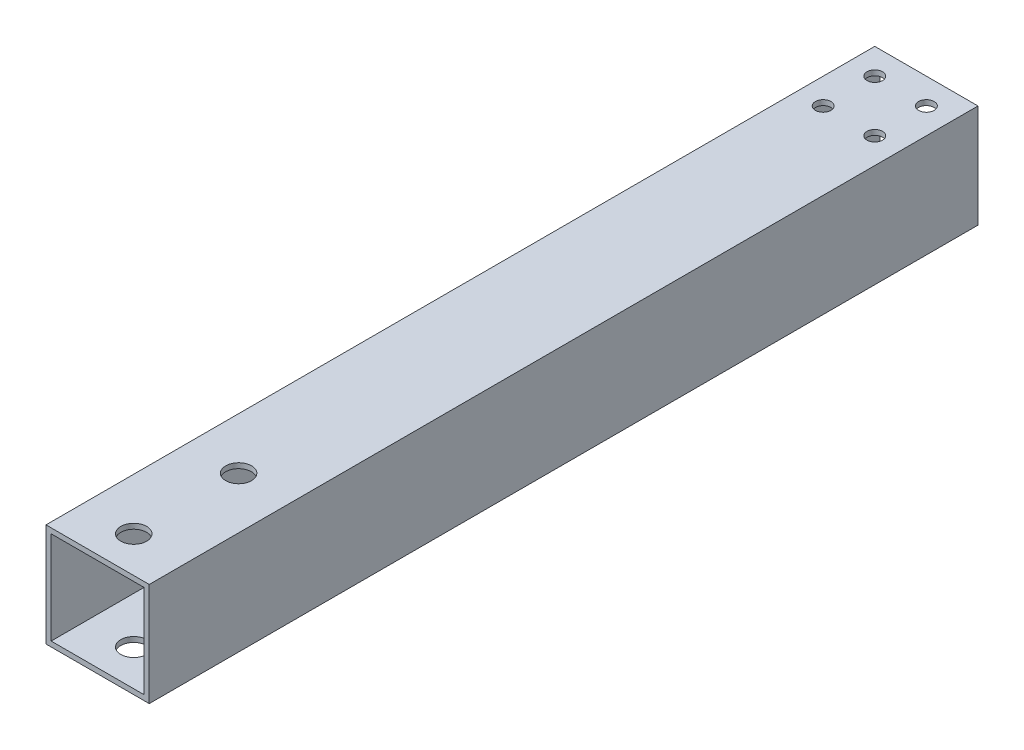
ISO-10303-21;
HEADER;
FILE_DESCRIPTION(('STEP AP214'),'2;1');
FILE_NAME('part.step','',(''),(''),'','','');
FILE_SCHEMA(('AUTOMOTIVE_DESIGN { 1 0 10303 214 1 1 1 1 }'));
ENDSEC;
DATA;
#1=APPLICATION_CONTEXT('core data for automotive mechanical design processes');
#2=APPLICATION_PROTOCOL_DEFINITION('international standard','automotive_design',2000,#1);
#3=PRODUCT_CONTEXT('',#1,'mechanical');
#4=PRODUCT('Part','Part','',(#3));
#5=PRODUCT_RELATED_PRODUCT_CATEGORY('part','',(#4));
#6=PRODUCT_DEFINITION_FORMATION('','',#4);
#7=PRODUCT_DEFINITION_CONTEXT('part definition',#1,'design');
#8=PRODUCT_DEFINITION('design','',#6,#7);
#9=PRODUCT_DEFINITION_SHAPE('','',#8);
#10=(LENGTH_UNIT() NAMED_UNIT(*) SI_UNIT(.MILLI.,.METRE.));
#11=(NAMED_UNIT(*) PLANE_ANGLE_UNIT() SI_UNIT($,.RADIAN.));
#12=(NAMED_UNIT(*) SI_UNIT($,.STERADIAN.) SOLID_ANGLE_UNIT());
#13=UNCERTAINTY_MEASURE_WITH_UNIT(LENGTH_MEASURE(1.E-05),#10,'distance_accuracy_value','');
#14=(GEOMETRIC_REPRESENTATION_CONTEXT(3) GLOBAL_UNCERTAINTY_ASSIGNED_CONTEXT((#13)) GLOBAL_UNIT_ASSIGNED_CONTEXT((#10,
#11,#12)) REPRESENTATION_CONTEXT('',''));
#15=CARTESIAN_POINT('',(0.,0.,0.));
#16=DIRECTION('',(0.,0.,1.));
#17=DIRECTION('',(1.,0.,0.));
#18=AXIS2_PLACEMENT_3D('',#15,#16,#17);
#19=CARTESIAN_POINT('',(10.,10.,171.98));
#20=DIRECTION('',(-1.,0.,0.));
#21=DIRECTION('',(0.,-1.,0.));
#22=AXIS2_PLACEMENT_3D('',#19,#20,#21);
#23=PLANE('',#22);
#24=DIRECTION('',(0.,1.,0.));
#25=VECTOR('',#24,1.);
#26=CARTESIAN_POINT('',(10.,-23.,160.58));
#27=LINE('',#26,#25);
#28=CARTESIAN_POINT('',(10.,-10.,160.58));
#29=VERTEX_POINT('',#28);
#30=CARTESIAN_POINT('',(10.,10.,160.58));
#31=VERTEX_POINT('',#30);
#32=EDGE_CURVE('E99',#29,#31,#27,.T.);
#33=ORIENTED_EDGE('',*,*,#32,.F.);
#34=DIRECTION('',(0.,0.,-1.));
#35=VECTOR('',#34,1.);
#36=CARTESIAN_POINT('',(10.,-10.,171.98));
#37=LINE('',#36,#35);
#38=CARTESIAN_POINT('',(10.,-10.,0.));
#39=VERTEX_POINT('',#38);
#40=EDGE_CURVE('E119',#29,#39,#37,.T.);
#41=ORIENTED_EDGE('',*,*,#40,.T.);
#42=DIRECTION('',(0.,1.,0.));
#43=VECTOR('',#42,1.);
#44=CARTESIAN_POINT('',(10.,10.,0.));
#45=LINE('',#44,#43);
#46=CARTESIAN_POINT('',(10.,10.,0.));
#47=VERTEX_POINT('',#46);
#48=EDGE_CURVE('E214',#39,#47,#45,.T.);
#49=ORIENTED_EDGE('',*,*,#48,.T.);
#50=DIRECTION('',(0.,0.,-1.));
#51=VECTOR('',#50,1.);
#52=CARTESIAN_POINT('',(10.,10.,171.98));
#53=LINE('',#52,#51);
#54=EDGE_CURVE('E42',#31,#47,#53,.T.);
#55=ORIENTED_EDGE('',*,*,#54,.F.);
#56=EDGE_LOOP('',(#33,#41,#49,#55));
#57=FACE_BOUND('',#56,.T.);
#58=ADVANCED_FACE('F35',(#57),#23,.F.);
#59=CARTESIAN_POINT('',(-9.99999999999999,10.,171.98));
#60=DIRECTION('',(0.,-1.,0.));
#61=DIRECTION('',(0.,0.,-1.));
#62=AXIS2_PLACEMENT_3D('',#59,#60,#61);
#63=PLANE('',#62);
#64=CARTESIAN_POINT('',(-4.99999999999999,10.,5.));
#65=DIRECTION('',(0.,1.,0.));
#66=DIRECTION('',(0.,0.,1.));
#67=AXIS2_PLACEMENT_3D('',#64,#65,#66);
#68=CIRCLE('',#67,1.5);
#69=CARTESIAN_POINT('',(-4.99999999999999,10.,6.5));
#70=VERTEX_POINT('',#69);
#71=EDGE_CURVE('E127',#70,#70,#68,.T.);
#72=ORIENTED_EDGE('',*,*,#71,.F.);
#73=EDGE_LOOP('',(#72));
#74=FACE_BOUND('',#73,.T.);
#75=CARTESIAN_POINT('',(5.00000000000001,10.,5.));
#76=DIRECTION('',(0.,1.,0.));
#77=DIRECTION('',(0.,0.,1.));
#78=AXIS2_PLACEMENT_3D('',#75,#76,#77);
#79=CIRCLE('',#78,1.5);
#80=CARTESIAN_POINT('',(5.00000000000001,10.,6.5));
#81=VERTEX_POINT('',#80);
#82=EDGE_CURVE('E170',#81,#81,#79,.T.);
#83=ORIENTED_EDGE('',*,*,#82,.F.);
#84=EDGE_LOOP('',(#83));
#85=FACE_BOUND('',#84,.T.);
#86=CARTESIAN_POINT('',(-4.99999999999999,10.,15.));
#87=DIRECTION('',(0.,1.,0.));
#88=DIRECTION('',(0.,0.,1.));
#89=AXIS2_PLACEMENT_3D('',#86,#87,#88);
#90=CIRCLE('',#89,1.5);
#91=CARTESIAN_POINT('',(-4.99999999999999,10.,16.5));
#92=VERTEX_POINT('',#91);
#93=EDGE_CURVE('E169',#92,#92,#90,.T.);
#94=ORIENTED_EDGE('',*,*,#93,.F.);
#95=EDGE_LOOP('',(#94));
#96=FACE_BOUND('',#95,.T.);
#97=CARTESIAN_POINT('',(5.00000000000001,10.,15.));
#98=DIRECTION('',(0.,1.,0.));
#99=DIRECTION('',(0.,0.,1.));
#100=AXIS2_PLACEMENT_3D('',#97,#98,#99);
#101=CIRCLE('',#100,1.5);
#102=CARTESIAN_POINT('',(5.00000000000001,10.,16.5));
#103=VERTEX_POINT('',#102);
#104=EDGE_CURVE('E166',#103,#103,#101,.T.);
#105=ORIENTED_EDGE('',*,*,#104,.F.);
#106=EDGE_LOOP('',(#105));
#107=FACE_BOUND('',#106,.T.);
#108=CARTESIAN_POINT('',(0.,10.,133.26));
#109=DIRECTION('',(0.,1.,0.));
#110=DIRECTION('',(0.,0.,1.));
#111=AXIS2_PLACEMENT_3D('',#108,#109,#110);
#112=CIRCLE('',#111,2.5);
#113=CARTESIAN_POINT('',(0.,10.,135.76));
#114=VERTEX_POINT('',#113);
#115=EDGE_CURVE('E260',#114,#114,#112,.T.);
#116=ORIENTED_EDGE('',*,*,#115,.F.);
#117=EDGE_LOOP('',(#116));
#118=FACE_BOUND('',#117,.T.);
#119=CARTESIAN_POINT('',(0.,10.,153.58));
#120=DIRECTION('',(0.,1.,0.));
#121=DIRECTION('',(0.,0.,1.));
#122=AXIS2_PLACEMENT_3D('',#119,#120,#121);
#123=CIRCLE('',#122,2.5);
#124=CARTESIAN_POINT('',(0.,10.,156.08));
#125=VERTEX_POINT('',#124);
#126=EDGE_CURVE('E146',#125,#125,#123,.T.);
#127=ORIENTED_EDGE('',*,*,#126,.F.);
#128=EDGE_LOOP('',(#127));
#129=FACE_BOUND('',#128,.T.);
#130=DIRECTION('',(1.,0.,0.));
#131=VECTOR('',#130,1.);
#132=CARTESIAN_POINT('',(-9.99999999999999,10.,160.58));
#133=LINE('',#132,#131);
#134=CARTESIAN_POINT('',(-9.99999999999999,10.,160.58));
#135=VERTEX_POINT('',#134);
#136=EDGE_CURVE('E96',#135,#31,#133,.T.);
#137=ORIENTED_EDGE('',*,*,#136,.T.);
#138=ORIENTED_EDGE('',*,*,#54,.T.);
#139=DIRECTION('',(-1.,0.,0.));
#140=VECTOR('',#139,1.);
#141=CARTESIAN_POINT('',(-9.99999999999999,10.,0.));
#142=LINE('',#141,#140);
#143=CARTESIAN_POINT('',(-9.99999999999999,10.,0.));
#144=VERTEX_POINT('',#143);
#145=EDGE_CURVE('E115',#47,#144,#142,.T.);
#146=ORIENTED_EDGE('',*,*,#145,.T.);
#147=DIRECTION('',(0.,0.,-1.));
#148=VECTOR('',#147,1.);
#149=CARTESIAN_POINT('',(-9.99999999999999,10.,171.98));
#150=LINE('',#149,#148);
#151=EDGE_CURVE('E108',#135,#144,#150,.T.);
#152=ORIENTED_EDGE('',*,*,#151,.F.);
#153=EDGE_LOOP('',(#137,#138,#146,#152));
#154=FACE_BOUND('',#153,.T.);
#155=ADVANCED_FACE('F113',(#74,#85,#96,#107,#118,#129,#154),#63,.F.);
#156=CARTESIAN_POINT('',(-9.99999999999999,10.,171.98));
#157=DIRECTION('',(1.,0.,0.));
#158=DIRECTION('',(0.,0.,-1.));
#159=AXIS2_PLACEMENT_3D('',#156,#157,#158);
#160=PLANE('',#159);
#161=DIRECTION('',(0.,1.,0.));
#162=VECTOR('',#161,1.);
#163=CARTESIAN_POINT('',(-9.99999999999999,-23.,160.58));
#164=LINE('',#163,#162);
#165=CARTESIAN_POINT('',(-9.99999999999999,-10.,160.58));
#166=VERTEX_POINT('',#165);
#167=EDGE_CURVE('E49',#166,#135,#164,.T.);
#168=ORIENTED_EDGE('',*,*,#167,.T.);
#169=ORIENTED_EDGE('',*,*,#151,.T.);
#170=DIRECTION('',(0.,-1.,0.));
#171=VECTOR('',#170,1.);
#172=CARTESIAN_POINT('',(-9.99999999999999,10.,0.));
#173=LINE('',#172,#171);
#174=CARTESIAN_POINT('',(-9.99999999999999,-10.,0.));
#175=VERTEX_POINT('',#174);
#176=EDGE_CURVE('E218',#144,#175,#173,.T.);
#177=ORIENTED_EDGE('',*,*,#176,.T.);
#178=DIRECTION('',(0.,0.,-1.));
#179=VECTOR('',#178,1.);
#180=CARTESIAN_POINT('',(-9.99999999999999,-10.,171.98));
#181=LINE('',#180,#179);
#182=EDGE_CURVE('E110',#166,#175,#181,.T.);
#183=ORIENTED_EDGE('',*,*,#182,.F.);
#184=EDGE_LOOP('',(#168,#169,#177,#183));
#185=FACE_BOUND('',#184,.T.);
#186=ADVANCED_FACE('F106',(#185),#160,.F.);
#187=CARTESIAN_POINT('',(-9.99999999999999,-10.,171.98));
#188=DIRECTION('',(0.,1.,0.));
#189=DIRECTION('',(0.,0.,1.));
#190=AXIS2_PLACEMENT_3D('',#187,#188,#189);
#191=PLANE('',#190);
#192=CARTESIAN_POINT('',(-4.99999999999999,-10.,5.));
#193=DIRECTION('',(0.,1.,0.));
#194=DIRECTION('',(0.,0.,1.));
#195=AXIS2_PLACEMENT_3D('',#192,#193,#194);
#196=CIRCLE('',#195,1.5);
#197=CARTESIAN_POINT('',(-4.99999999999999,-10.,6.5));
#198=VERTEX_POINT('',#197);
#199=EDGE_CURVE('E132',#198,#198,#196,.T.);
#200=ORIENTED_EDGE('',*,*,#199,.T.);
#201=EDGE_LOOP('',(#200));
#202=FACE_BOUND('',#201,.T.);
#203=CARTESIAN_POINT('',(5.00000000000001,-10.,5.));
#204=DIRECTION('',(0.,1.,0.));
#205=DIRECTION('',(0.,0.,1.));
#206=AXIS2_PLACEMENT_3D('',#203,#204,#205);
#207=CIRCLE('',#206,1.5);
#208=CARTESIAN_POINT('',(5.00000000000001,-10.,6.5));
#209=VERTEX_POINT('',#208);
#210=EDGE_CURVE('E137',#209,#209,#207,.T.);
#211=ORIENTED_EDGE('',*,*,#210,.T.);
#212=EDGE_LOOP('',(#211));
#213=FACE_BOUND('',#212,.T.);
#214=CARTESIAN_POINT('',(-4.99999999999999,-10.,15.));
#215=DIRECTION('',(0.,1.,0.));
#216=DIRECTION('',(0.,0.,1.));
#217=AXIS2_PLACEMENT_3D('',#214,#215,#216);
#218=CIRCLE('',#217,1.5);
#219=CARTESIAN_POINT('',(-4.99999999999999,-10.,16.5));
#220=VERTEX_POINT('',#219);
#221=EDGE_CURVE('E142',#220,#220,#218,.T.);
#222=ORIENTED_EDGE('',*,*,#221,.T.);
#223=EDGE_LOOP('',(#222));
#224=FACE_BOUND('',#223,.T.);
#225=CARTESIAN_POINT('',(5.00000000000001,-10.,15.));
#226=DIRECTION('',(0.,1.,0.));
#227=DIRECTION('',(0.,0.,1.));
#228=AXIS2_PLACEMENT_3D('',#225,#226,#227);
#229=CIRCLE('',#228,1.5);
#230=CARTESIAN_POINT('',(5.00000000000001,-10.,16.5));
#231=VERTEX_POINT('',#230);
#232=EDGE_CURVE('E191',#231,#231,#229,.T.);
#233=ORIENTED_EDGE('',*,*,#232,.T.);
#234=EDGE_LOOP('',(#233));
#235=FACE_BOUND('',#234,.T.);
#236=CARTESIAN_POINT('',(0.,-10.,133.26));
#237=DIRECTION('',(0.,1.,0.));
#238=DIRECTION('',(0.,0.,1.));
#239=AXIS2_PLACEMENT_3D('',#236,#237,#238);
#240=CIRCLE('',#239,2.5);
#241=CARTESIAN_POINT('',(0.,-10.,135.76));
#242=VERTEX_POINT('',#241);
#243=EDGE_CURVE('E150',#242,#242,#240,.T.);
#244=ORIENTED_EDGE('',*,*,#243,.T.);
#245=EDGE_LOOP('',(#244));
#246=FACE_BOUND('',#245,.T.);
#247=CARTESIAN_POINT('',(0.,-10.,153.58));
#248=DIRECTION('',(0.,1.,0.));
#249=DIRECTION('',(0.,0.,1.));
#250=AXIS2_PLACEMENT_3D('',#247,#248,#249);
#251=CIRCLE('',#250,2.5);
#252=CARTESIAN_POINT('',(0.,-10.,156.08));
#253=VERTEX_POINT('',#252);
#254=EDGE_CURVE('E154',#253,#253,#251,.T.);
#255=ORIENTED_EDGE('',*,*,#254,.T.);
#256=EDGE_LOOP('',(#255));
#257=FACE_BOUND('',#256,.T.);
#258=DIRECTION('',(1.,0.,0.));
#259=VECTOR('',#258,1.);
#260=CARTESIAN_POINT('',(-9.99999999999999,-10.,160.58));
#261=LINE('',#260,#259);
#262=EDGE_CURVE('E258',#166,#29,#261,.T.);
#263=ORIENTED_EDGE('',*,*,#262,.F.);
#264=ORIENTED_EDGE('',*,*,#182,.T.);
#265=DIRECTION('',(1.,0.,0.));
#266=VECTOR('',#265,1.);
#267=CARTESIAN_POINT('',(-9.99999999999999,-10.,0.));
#268=LINE('',#267,#266);
#269=EDGE_CURVE('E220',#175,#39,#268,.T.);
#270=ORIENTED_EDGE('',*,*,#269,.T.);
#271=ORIENTED_EDGE('',*,*,#40,.F.);
#272=EDGE_LOOP('',(#263,#264,#270,#271));
#273=FACE_BOUND('',#272,.T.);
#274=ADVANCED_FACE('F227',(#202,#213,#224,#235,#246,#257,#273),#191,.F.);
#275=CARTESIAN_POINT('',(9.00000000000001,9.,171.98));
#276=DIRECTION('',(-1.,0.,0.));
#277=DIRECTION('',(0.,-1.,0.));
#278=AXIS2_PLACEMENT_3D('',#275,#276,#277);
#279=PLANE('',#278);
#280=DIRECTION('',(0.,0.,-1.));
#281=VECTOR('',#280,1.);
#282=CARTESIAN_POINT('',(9.00000000000001,-9.,171.98));
#283=LINE('',#282,#281);
#284=CARTESIAN_POINT('',(9.00000000000001,-9.,160.58));
#285=VERTEX_POINT('',#284);
#286=CARTESIAN_POINT('',(9.00000000000001,-9.,0.));
#287=VERTEX_POINT('',#286);
#288=EDGE_CURVE('E206',#285,#287,#283,.T.);
#289=ORIENTED_EDGE('',*,*,#288,.F.);
#290=DIRECTION('',(0.,1.,0.));
#291=VECTOR('',#290,1.);
#292=CARTESIAN_POINT('',(9.00000000000001,9.,160.58));
#293=LINE('',#292,#291);
#294=CARTESIAN_POINT('',(9.,9.,160.58));
#295=VERTEX_POINT('',#294);
#296=EDGE_CURVE('E57',#285,#295,#293,.T.);
#297=ORIENTED_EDGE('',*,*,#296,.T.);
#298=DIRECTION('',(0.,0.,-1.));
#299=VECTOR('',#298,1.);
#300=CARTESIAN_POINT('',(9.00000000000001,9.,171.98));
#301=LINE('',#300,#299);
#302=CARTESIAN_POINT('',(9.00000000000001,9.,0.));
#303=VERTEX_POINT('',#302);
#304=EDGE_CURVE('E212',#295,#303,#301,.T.);
#305=ORIENTED_EDGE('',*,*,#304,.T.);
#306=DIRECTION('',(0.,1.,0.));
#307=VECTOR('',#306,1.);
#308=CARTESIAN_POINT('',(9.00000000000001,9.,0.));
#309=LINE('',#308,#307);
#310=EDGE_CURVE('E194',#287,#303,#309,.T.);
#311=ORIENTED_EDGE('',*,*,#310,.F.);
#312=EDGE_LOOP('',(#289,#297,#305,#311));
#313=FACE_BOUND('',#312,.T.);
#314=ADVANCED_FACE('F240',(#313),#279,.T.);
#315=CARTESIAN_POINT('',(-8.99999999999999,9.,171.98));
#316=DIRECTION('',(0.,-1.,0.));
#317=DIRECTION('',(0.,0.,-1.));
#318=AXIS2_PLACEMENT_3D('',#315,#316,#317);
#319=PLANE('',#318);
#320=CARTESIAN_POINT('',(0.,9.,153.58));
#321=DIRECTION('',(0.,-1.,0.));
#322=DIRECTION('',(0.,0.,-1.));
#323=AXIS2_PLACEMENT_3D('',#320,#321,#322);
#324=CIRCLE('',#323,2.5);
#325=CARTESIAN_POINT('',(0.,9.,151.08));
#326=VERTEX_POINT('',#325);
#327=EDGE_CURVE('E149',#326,#326,#324,.T.);
#328=ORIENTED_EDGE('',*,*,#327,.F.);
#329=EDGE_LOOP('',(#328));
#330=FACE_BOUND('',#329,.T.);
#331=CARTESIAN_POINT('',(0.,9.,133.26));
#332=DIRECTION('',(0.,-1.,0.));
#333=DIRECTION('',(0.,0.,-1.));
#334=AXIS2_PLACEMENT_3D('',#331,#332,#333);
#335=CIRCLE('',#334,2.5);
#336=CARTESIAN_POINT('',(0.,9.,130.76));
#337=VERTEX_POINT('',#336);
#338=EDGE_CURVE('E145',#337,#337,#335,.T.);
#339=ORIENTED_EDGE('',*,*,#338,.F.);
#340=EDGE_LOOP('',(#339));
#341=FACE_BOUND('',#340,.T.);
#342=CARTESIAN_POINT('',(5.00000000000001,9.,15.));
#343=DIRECTION('',(0.,-1.,0.));
#344=DIRECTION('',(0.,0.,-1.));
#345=AXIS2_PLACEMENT_3D('',#342,#343,#344);
#346=CIRCLE('',#345,1.5);
#347=CARTESIAN_POINT('',(5.00000000000001,9.,13.5));
#348=VERTEX_POINT('',#347);
#349=EDGE_CURVE('E141',#348,#348,#346,.T.);
#350=ORIENTED_EDGE('',*,*,#349,.F.);
#351=EDGE_LOOP('',(#350));
#352=FACE_BOUND('',#351,.T.);
#353=CARTESIAN_POINT('',(-4.99999999999999,9.,15.));
#354=DIRECTION('',(0.,-1.,0.));
#355=DIRECTION('',(0.,0.,-1.));
#356=AXIS2_PLACEMENT_3D('',#353,#354,#355);
#357=CIRCLE('',#356,1.5);
#358=CARTESIAN_POINT('',(-4.99999999999999,9.,13.5));
#359=VERTEX_POINT('',#358);
#360=EDGE_CURVE('E136',#359,#359,#357,.T.);
#361=ORIENTED_EDGE('',*,*,#360,.F.);
#362=EDGE_LOOP('',(#361));
#363=FACE_BOUND('',#362,.T.);
#364=CARTESIAN_POINT('',(5.00000000000001,9.,5.));
#365=DIRECTION('',(0.,-1.,0.));
#366=DIRECTION('',(0.,0.,-1.));
#367=AXIS2_PLACEMENT_3D('',#364,#365,#366);
#368=CIRCLE('',#367,1.5);
#369=CARTESIAN_POINT('',(5.00000000000001,9.,3.5));
#370=VERTEX_POINT('',#369);
#371=EDGE_CURVE('E131',#370,#370,#368,.T.);
#372=ORIENTED_EDGE('',*,*,#371,.F.);
#373=EDGE_LOOP('',(#372));
#374=FACE_BOUND('',#373,.T.);
#375=CARTESIAN_POINT('',(-4.99999999999999,9.,5.));
#376=DIRECTION('',(0.,-1.,0.));
#377=DIRECTION('',(0.,0.,-1.));
#378=AXIS2_PLACEMENT_3D('',#375,#376,#377);
#379=CIRCLE('',#378,1.5);
#380=CARTESIAN_POINT('',(-4.99999999999999,9.,3.5));
#381=VERTEX_POINT('',#380);
#382=EDGE_CURVE('E126',#381,#381,#379,.T.);
#383=ORIENTED_EDGE('',*,*,#382,.F.);
#384=EDGE_LOOP('',(#383));
#385=FACE_BOUND('',#384,.T.);
#386=ORIENTED_EDGE('',*,*,#304,.F.);
#387=DIRECTION('',(-1.,0.,0.));
#388=VECTOR('',#387,1.);
#389=CARTESIAN_POINT('',(-8.99999999999999,9.,160.58));
#390=LINE('',#389,#388);
#391=CARTESIAN_POINT('',(-8.99999999999999,9.,160.58));
#392=VERTEX_POINT('',#391);
#393=EDGE_CURVE('E247',#295,#392,#390,.T.);
#394=ORIENTED_EDGE('',*,*,#393,.T.);
#395=DIRECTION('',(0.,0.,-1.));
#396=VECTOR('',#395,1.);
#397=CARTESIAN_POINT('',(-8.99999999999999,9.,171.98));
#398=LINE('',#397,#396);
#399=CARTESIAN_POINT('',(-8.99999999999999,9.,0.));
#400=VERTEX_POINT('',#399);
#401=EDGE_CURVE('E210',#392,#400,#398,.T.);
#402=ORIENTED_EDGE('',*,*,#401,.T.);
#403=DIRECTION('',(-1.,0.,0.));
#404=VECTOR('',#403,1.);
#405=CARTESIAN_POINT('',(-8.99999999999999,9.,0.));
#406=LINE('',#405,#404);
#407=EDGE_CURVE('E197',#303,#400,#406,.T.);
#408=ORIENTED_EDGE('',*,*,#407,.F.);
#409=EDGE_LOOP('',(#386,#394,#402,#408));
#410=FACE_BOUND('',#409,.T.);
#411=ADVANCED_FACE('F244',(#330,#341,#352,#363,#374,#385,#410),#319,.T.);
#412=CARTESIAN_POINT('',(-8.99999999999999,9.,171.98));
#413=DIRECTION('',(1.,0.,0.));
#414=DIRECTION('',(0.,1.,0.));
#415=AXIS2_PLACEMENT_3D('',#412,#413,#414);
#416=PLANE('',#415);
#417=ORIENTED_EDGE('',*,*,#401,.F.);
#418=DIRECTION('',(0.,-1.,0.));
#419=VECTOR('',#418,1.);
#420=CARTESIAN_POINT('',(-8.99999999999999,9.,160.58));
#421=LINE('',#420,#419);
#422=CARTESIAN_POINT('',(-8.99999999999999,-9.,160.58));
#423=VERTEX_POINT('',#422);
#424=EDGE_CURVE('E111',#392,#423,#421,.T.);
#425=ORIENTED_EDGE('',*,*,#424,.T.);
#426=DIRECTION('',(0.,0.,-1.));
#427=VECTOR('',#426,1.);
#428=CARTESIAN_POINT('',(-8.99999999999999,-9.,171.98));
#429=LINE('',#428,#427);
#430=CARTESIAN_POINT('',(-8.99999999999999,-9.,0.));
#431=VERTEX_POINT('',#430);
#432=EDGE_CURVE('E208',#423,#431,#429,.T.);
#433=ORIENTED_EDGE('',*,*,#432,.T.);
#434=DIRECTION('',(0.,-1.,0.));
#435=VECTOR('',#434,1.);
#436=CARTESIAN_POINT('',(-8.99999999999999,9.,0.));
#437=LINE('',#436,#435);
#438=EDGE_CURVE('E200',#400,#431,#437,.T.);
#439=ORIENTED_EDGE('',*,*,#438,.F.);
#440=EDGE_LOOP('',(#417,#425,#433,#439));
#441=FACE_BOUND('',#440,.T.);
#442=ADVANCED_FACE('F250',(#441),#416,.T.);
#443=CARTESIAN_POINT('',(-8.99999999999999,-9.,171.98));
#444=DIRECTION('',(0.,1.,0.));
#445=DIRECTION('',(0.,0.,1.));
#446=AXIS2_PLACEMENT_3D('',#443,#444,#445);
#447=PLANE('',#446);
#448=CARTESIAN_POINT('',(0.,-9.,153.58));
#449=DIRECTION('',(0.,1.,0.));
#450=DIRECTION('',(0.,0.,1.));
#451=AXIS2_PLACEMENT_3D('',#448,#449,#450);
#452=CIRCLE('',#451,2.5);
#453=CARTESIAN_POINT('',(0.,-9.,156.08));
#454=VERTEX_POINT('',#453);
#455=EDGE_CURVE('E147',#454,#454,#452,.T.);
#456=ORIENTED_EDGE('',*,*,#455,.F.);
#457=EDGE_LOOP('',(#456));
#458=FACE_BOUND('',#457,.T.);
#459=CARTESIAN_POINT('',(0.,-9.,133.26));
#460=DIRECTION('',(0.,1.,0.));
#461=DIRECTION('',(0.,0.,1.));
#462=AXIS2_PLACEMENT_3D('',#459,#460,#461);
#463=CIRCLE('',#462,2.5);
#464=CARTESIAN_POINT('',(0.,-9.,135.76));
#465=VERTEX_POINT('',#464);
#466=EDGE_CURVE('E143',#465,#465,#463,.T.);
#467=ORIENTED_EDGE('',*,*,#466,.F.);
#468=EDGE_LOOP('',(#467));
#469=FACE_BOUND('',#468,.T.);
#470=CARTESIAN_POINT('',(5.00000000000001,-9.,15.));
#471=DIRECTION('',(0.,1.,0.));
#472=DIRECTION('',(0.,0.,1.));
#473=AXIS2_PLACEMENT_3D('',#470,#471,#472);
#474=CIRCLE('',#473,1.5);
#475=CARTESIAN_POINT('',(5.00000000000001,-9.,16.5));
#476=VERTEX_POINT('',#475);
#477=EDGE_CURVE('E138',#476,#476,#474,.T.);
#478=ORIENTED_EDGE('',*,*,#477,.F.);
#479=EDGE_LOOP('',(#478));
#480=FACE_BOUND('',#479,.T.);
#481=CARTESIAN_POINT('',(-4.99999999999999,-9.,15.));
#482=DIRECTION('',(0.,1.,0.));
#483=DIRECTION('',(0.,0.,1.));
#484=AXIS2_PLACEMENT_3D('',#481,#482,#483);
#485=CIRCLE('',#484,1.5);
#486=CARTESIAN_POINT('',(-4.99999999999999,-9.,16.5));
#487=VERTEX_POINT('',#486);
#488=EDGE_CURVE('E133',#487,#487,#485,.T.);
#489=ORIENTED_EDGE('',*,*,#488,.F.);
#490=EDGE_LOOP('',(#489));
#491=FACE_BOUND('',#490,.T.);
#492=CARTESIAN_POINT('',(5.00000000000001,-9.,5.));
#493=DIRECTION('',(0.,1.,0.));
#494=DIRECTION('',(0.,0.,1.));
#495=AXIS2_PLACEMENT_3D('',#492,#493,#494);
#496=CIRCLE('',#495,1.5);
#497=CARTESIAN_POINT('',(5.00000000000001,-9.,6.5));
#498=VERTEX_POINT('',#497);
#499=EDGE_CURVE('E128',#498,#498,#496,.T.);
#500=ORIENTED_EDGE('',*,*,#499,.F.);
#501=EDGE_LOOP('',(#500));
#502=FACE_BOUND('',#501,.T.);
#503=CARTESIAN_POINT('',(-4.99999999999999,-9.,5.));
#504=DIRECTION('',(0.,1.,0.));
#505=DIRECTION('',(0.,0.,1.));
#506=AXIS2_PLACEMENT_3D('',#503,#504,#505);
#507=CIRCLE('',#506,1.5);
#508=CARTESIAN_POINT('',(-4.99999999999999,-9.,6.5));
#509=VERTEX_POINT('',#508);
#510=EDGE_CURVE('E123',#509,#509,#507,.T.);
#511=ORIENTED_EDGE('',*,*,#510,.F.);
#512=EDGE_LOOP('',(#511));
#513=FACE_BOUND('',#512,.T.);
#514=ORIENTED_EDGE('',*,*,#432,.F.);
#515=DIRECTION('',(1.,0.,0.));
#516=VECTOR('',#515,1.);
#517=CARTESIAN_POINT('',(-8.99999999999999,-9.,160.58));
#518=LINE('',#517,#516);
#519=EDGE_CURVE('E11',#423,#285,#518,.T.);
#520=ORIENTED_EDGE('',*,*,#519,.T.);
#521=ORIENTED_EDGE('',*,*,#288,.T.);
#522=DIRECTION('',(1.,0.,0.));
#523=VECTOR('',#522,1.);
#524=CARTESIAN_POINT('',(-8.99999999999999,-9.,0.));
#525=LINE('',#524,#523);
#526=EDGE_CURVE('E203',#431,#287,#525,.T.);
#527=ORIENTED_EDGE('',*,*,#526,.F.);
#528=EDGE_LOOP('',(#514,#520,#521,#527));
#529=FACE_BOUND('',#528,.T.);
#530=ADVANCED_FACE('F233',(#458,#469,#480,#491,#502,#513,#529),#447,.T.);
#531=CARTESIAN_POINT('',(0.,0.,0.));
#532=DIRECTION('',(0.,0.,1.));
#533=DIRECTION('',(1.,0.,0.));
#534=AXIS2_PLACEMENT_3D('',#531,#532,#533);
#535=PLANE('',#534);
#536=ORIENTED_EDGE('',*,*,#48,.F.);
#537=ORIENTED_EDGE('',*,*,#269,.F.);
#538=ORIENTED_EDGE('',*,*,#176,.F.);
#539=ORIENTED_EDGE('',*,*,#145,.F.);
#540=EDGE_LOOP('',(#536,#537,#538,#539));
#541=FACE_BOUND('',#540,.T.);
#542=ORIENTED_EDGE('',*,*,#310,.T.);
#543=ORIENTED_EDGE('',*,*,#407,.T.);
#544=ORIENTED_EDGE('',*,*,#438,.T.);
#545=ORIENTED_EDGE('',*,*,#526,.T.);
#546=EDGE_LOOP('',(#542,#543,#544,#545));
#547=FACE_BOUND('',#546,.T.);
#548=ADVANCED_FACE('F229',(#541,#547),#535,.F.);
#549=CARTESIAN_POINT('',(-4.99999999999999,-40.,5.));
#550=DIRECTION('',(0.,1.,0.));
#551=DIRECTION('',(0.,0.,1.));
#552=AXIS2_PLACEMENT_3D('',#549,#550,#551);
#553=CYLINDRICAL_SURFACE('',#552,1.5);
#554=ORIENTED_EDGE('',*,*,#510,.T.);
#555=EDGE_LOOP('',(#554));
#556=FACE_BOUND('',#555,.T.);
#557=ORIENTED_EDGE('',*,*,#199,.F.);
#558=EDGE_LOOP('',(#557));
#559=FACE_BOUND('',#558,.T.);
#560=ADVANCED_FACE('F232',(#556,#559),#553,.F.);
#561=CARTESIAN_POINT('',(5.00000000000001,-40.,5.));
#562=DIRECTION('',(0.,1.,0.));
#563=DIRECTION('',(0.,0.,1.));
#564=AXIS2_PLACEMENT_3D('',#561,#562,#563);
#565=CYLINDRICAL_SURFACE('',#564,1.5);
#566=ORIENTED_EDGE('',*,*,#499,.T.);
#567=EDGE_LOOP('',(#566));
#568=FACE_BOUND('',#567,.T.);
#569=ORIENTED_EDGE('',*,*,#210,.F.);
#570=EDGE_LOOP('',(#569));
#571=FACE_BOUND('',#570,.T.);
#572=ADVANCED_FACE('F343',(#568,#571),#565,.F.);
#573=CARTESIAN_POINT('',(-4.99999999999999,-40.,15.));
#574=DIRECTION('',(0.,1.,0.));
#575=DIRECTION('',(0.,0.,1.));
#576=AXIS2_PLACEMENT_3D('',#573,#574,#575);
#577=CYLINDRICAL_SURFACE('',#576,1.5);
#578=ORIENTED_EDGE('',*,*,#488,.T.);
#579=EDGE_LOOP('',(#578));
#580=FACE_BOUND('',#579,.T.);
#581=ORIENTED_EDGE('',*,*,#221,.F.);
#582=EDGE_LOOP('',(#581));
#583=FACE_BOUND('',#582,.T.);
#584=ADVANCED_FACE('F352',(#580,#583),#577,.F.);
#585=CARTESIAN_POINT('',(5.00000000000001,-40.,15.));
#586=DIRECTION('',(0.,1.,0.));
#587=DIRECTION('',(0.,0.,1.));
#588=AXIS2_PLACEMENT_3D('',#585,#586,#587);
#589=CYLINDRICAL_SURFACE('',#588,1.5);
#590=ORIENTED_EDGE('',*,*,#477,.T.);
#591=EDGE_LOOP('',(#590));
#592=FACE_BOUND('',#591,.T.);
#593=ORIENTED_EDGE('',*,*,#232,.F.);
#594=EDGE_LOOP('',(#593));
#595=FACE_BOUND('',#594,.T.);
#596=ADVANCED_FACE('F361',(#592,#595),#589,.F.);
#597=ORIENTED_EDGE('',*,*,#382,.T.);
#598=EDGE_LOOP('',(#597));
#599=FACE_BOUND('',#598,.T.);
#600=ORIENTED_EDGE('',*,*,#71,.T.);
#601=EDGE_LOOP('',(#600));
#602=FACE_BOUND('',#601,.T.);
#603=ADVANCED_FACE('F346',(#599,#602),#553,.F.);
#604=ORIENTED_EDGE('',*,*,#371,.T.);
#605=EDGE_LOOP('',(#604));
#606=FACE_BOUND('',#605,.T.);
#607=ORIENTED_EDGE('',*,*,#82,.T.);
#608=EDGE_LOOP('',(#607));
#609=FACE_BOUND('',#608,.T.);
#610=ADVANCED_FACE('F355',(#606,#609),#565,.F.);
#611=ORIENTED_EDGE('',*,*,#360,.T.);
#612=EDGE_LOOP('',(#611));
#613=FACE_BOUND('',#612,.T.);
#614=ORIENTED_EDGE('',*,*,#93,.T.);
#615=EDGE_LOOP('',(#614));
#616=FACE_BOUND('',#615,.T.);
#617=ADVANCED_FACE('F364',(#613,#616),#577,.F.);
#618=ORIENTED_EDGE('',*,*,#349,.T.);
#619=EDGE_LOOP('',(#618));
#620=FACE_BOUND('',#619,.T.);
#621=ORIENTED_EDGE('',*,*,#104,.T.);
#622=EDGE_LOOP('',(#621));
#623=FACE_BOUND('',#622,.T.);
#624=ADVANCED_FACE('F372',(#620,#623),#589,.F.);
#625=CARTESIAN_POINT('',(0.,-26.,133.26));
#626=DIRECTION('',(0.,1.,0.));
#627=DIRECTION('',(0.,0.,1.));
#628=AXIS2_PLACEMENT_3D('',#625,#626,#627);
#629=CYLINDRICAL_SURFACE('',#628,2.5);
#630=ORIENTED_EDGE('',*,*,#466,.T.);
#631=EDGE_LOOP('',(#630));
#632=FACE_BOUND('',#631,.T.);
#633=ORIENTED_EDGE('',*,*,#243,.F.);
#634=EDGE_LOOP('',(#633));
#635=FACE_BOUND('',#634,.T.);
#636=ADVANCED_FACE('F284',(#632,#635),#629,.F.);
#637=CARTESIAN_POINT('',(0.,-26.,153.58));
#638=DIRECTION('',(0.,1.,0.));
#639=DIRECTION('',(0.,0.,1.));
#640=AXIS2_PLACEMENT_3D('',#637,#638,#639);
#641=CYLINDRICAL_SURFACE('',#640,2.5);
#642=ORIENTED_EDGE('',*,*,#455,.T.);
#643=EDGE_LOOP('',(#642));
#644=FACE_BOUND('',#643,.T.);
#645=ORIENTED_EDGE('',*,*,#254,.F.);
#646=EDGE_LOOP('',(#645));
#647=FACE_BOUND('',#646,.T.);
#648=ADVANCED_FACE('F276',(#644,#647),#641,.F.);
#649=ORIENTED_EDGE('',*,*,#338,.T.);
#650=EDGE_LOOP('',(#649));
#651=FACE_BOUND('',#650,.T.);
#652=ORIENTED_EDGE('',*,*,#115,.T.);
#653=EDGE_LOOP('',(#652));
#654=FACE_BOUND('',#653,.T.);
#655=ADVANCED_FACE('F265',(#651,#654),#629,.F.);
#656=ORIENTED_EDGE('',*,*,#327,.T.);
#657=EDGE_LOOP('',(#656));
#658=FACE_BOUND('',#657,.T.);
#659=ORIENTED_EDGE('',*,*,#126,.T.);
#660=EDGE_LOOP('',(#659));
#661=FACE_BOUND('',#660,.T.);
#662=ADVANCED_FACE('F272',(#658,#661),#641,.F.);
#663=CARTESIAN_POINT('',(-9.99999999999999,-23.,160.58));
#664=DIRECTION('',(0.,0.,1.));
#665=DIRECTION('',(1.,0.,0.));
#666=AXIS2_PLACEMENT_3D('',#663,#664,#665);
#667=PLANE('',#666);
#668=ORIENTED_EDGE('',*,*,#519,.F.);
#669=ORIENTED_EDGE('',*,*,#424,.F.);
#670=ORIENTED_EDGE('',*,*,#393,.F.);
#671=ORIENTED_EDGE('',*,*,#296,.F.);
#672=EDGE_LOOP('',(#668,#669,#670,#671));
#673=FACE_BOUND('',#672,.T.);
#674=ORIENTED_EDGE('',*,*,#262,.T.);
#675=ORIENTED_EDGE('',*,*,#32,.T.);
#676=ORIENTED_EDGE('',*,*,#136,.F.);
#677=ORIENTED_EDGE('',*,*,#167,.F.);
#678=EDGE_LOOP('',(#674,#675,#676,#677));
#679=FACE_BOUND('',#678,.T.);
#680=ADVANCED_FACE('F97',(#673,#679),#667,.T.);
#681=CLOSED_SHELL('',(#58,#155,#186,#274,#314,#411,#442,#530,#548,#560,#572,#584,#596,#603,#610,
#617,#624,#636,#648,#655,#662,#680));
#682=MANIFOLD_SOLID_BREP('B2',#681);
#683=ADVANCED_BREP_SHAPE_REPRESENTATION('',(#18,#682),#14);
#684=SHAPE_DEFINITION_REPRESENTATION(#9,#683);
ENDSEC;
END-ISO-10303-21;
